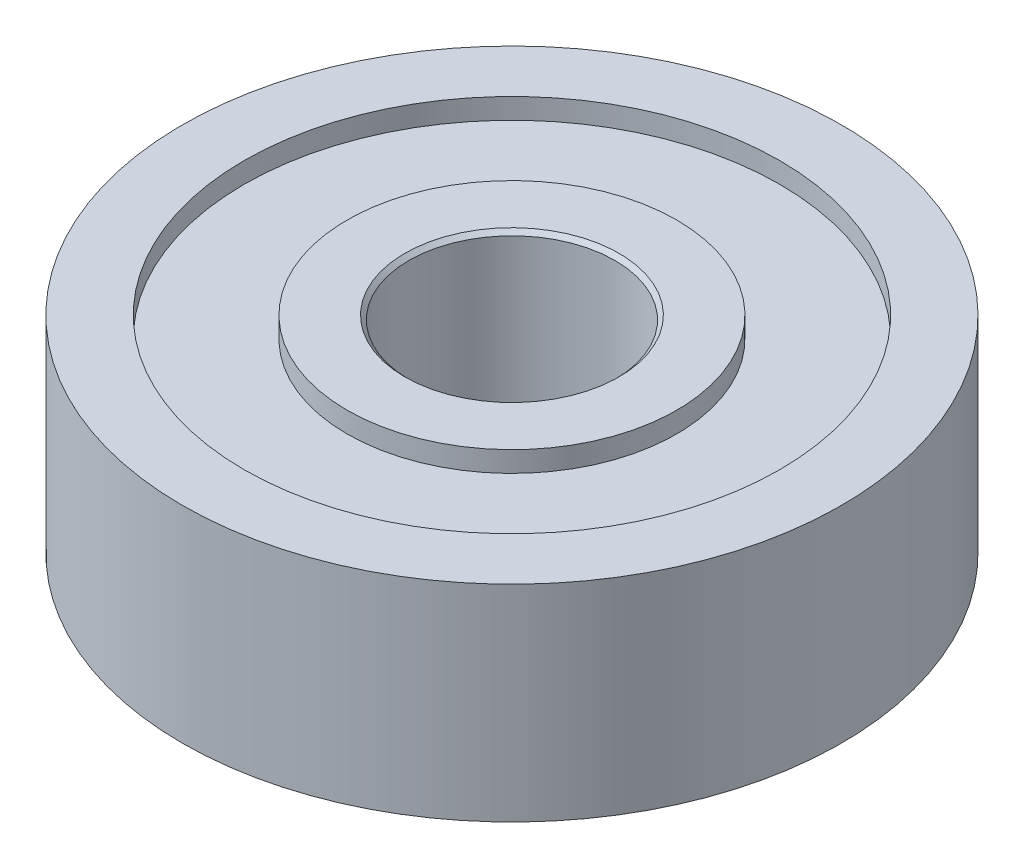
ISO-10303-21;
HEADER;
FILE_DESCRIPTION(('STEP AP214'),'2;1');
FILE_NAME('part.step','',(''),(''),'','','');
FILE_SCHEMA(('AUTOMOTIVE_DESIGN { 1 0 10303 214 1 1 1 1 }'));
ENDSEC;
DATA;
#1=APPLICATION_CONTEXT('core data for automotive mechanical design processes');
#2=APPLICATION_PROTOCOL_DEFINITION('international standard','automotive_design',2000,#1);
#3=PRODUCT_CONTEXT('',#1,'mechanical');
#4=PRODUCT('Part','Part','',(#3));
#5=PRODUCT_RELATED_PRODUCT_CATEGORY('part','',(#4));
#6=PRODUCT_DEFINITION_FORMATION('','',#4);
#7=PRODUCT_DEFINITION_CONTEXT('part definition',#1,'design');
#8=PRODUCT_DEFINITION('design','',#6,#7);
#9=PRODUCT_DEFINITION_SHAPE('','',#8);
#10=(LENGTH_UNIT() NAMED_UNIT(*) SI_UNIT(.MILLI.,.METRE.));
#11=(NAMED_UNIT(*) PLANE_ANGLE_UNIT() SI_UNIT($,.RADIAN.));
#12=(NAMED_UNIT(*) SI_UNIT($,.STERADIAN.) SOLID_ANGLE_UNIT());
#13=UNCERTAINTY_MEASURE_WITH_UNIT(LENGTH_MEASURE(1.E-05),#10,'distance_accuracy_value','');
#14=(GEOMETRIC_REPRESENTATION_CONTEXT(3) GLOBAL_UNCERTAINTY_ASSIGNED_CONTEXT((#13)) GLOBAL_UNIT_ASSIGNED_CONTEXT((#10,
#11,#12)) REPRESENTATION_CONTEXT('',''));
#15=CARTESIAN_POINT('',(0.,0.,0.));
#16=DIRECTION('',(0.,0.,1.));
#17=DIRECTION('',(1.,0.,0.));
#18=AXIS2_PLACEMENT_3D('',#15,#16,#17);
#19=CARTESIAN_POINT('',(0.,-2.5,0.));
#20=DIRECTION('',(0.,1.,0.));
#21=DIRECTION('',(0.,0.,1.));
#22=AXIS2_PLACEMENT_3D('',#19,#20,#21);
#23=PLANE('',#22);
#24=CARTESIAN_POINT('',(0.,-2.5,0.));
#25=DIRECTION('',(0.,1.,0.));
#26=DIRECTION('',(0.,0.,1.));
#27=AXIS2_PLACEMENT_3D('',#24,#25,#26);
#28=CIRCLE('',#27,2.6);
#29=CARTESIAN_POINT('',(0.,-2.5,2.6));
#30=VERTEX_POINT('',#29);
#31=EDGE_CURVE('E10',#30,#30,#28,.T.);
#32=ORIENTED_EDGE('',*,*,#31,.T.);
#33=EDGE_LOOP('',(#32));
#34=FACE_BOUND('',#33,.T.);
#35=CARTESIAN_POINT('',(0.,-2.5,0.));
#36=DIRECTION('',(0.,1.,0.));
#37=DIRECTION('',(0.,0.,1.));
#38=AXIS2_PLACEMENT_3D('',#35,#36,#37);
#39=CIRCLE('',#38,4.);
#40=CARTESIAN_POINT('',(0.,-2.5,4.));
#41=VERTEX_POINT('',#40);
#42=EDGE_CURVE('E84',#41,#41,#39,.T.);
#43=ORIENTED_EDGE('',*,*,#42,.F.);
#44=EDGE_LOOP('',(#43));
#45=FACE_BOUND('',#44,.T.);
#46=ADVANCED_FACE('F38',(#34,#45),#23,.F.);
#47=CARTESIAN_POINT('',(0.,2.5,0.));
#48=DIRECTION('',(0.,1.,0.));
#49=DIRECTION('',(0.,0.,1.));
#50=AXIS2_PLACEMENT_3D('',#47,#48,#49);
#51=PLANE('',#50);
#52=CARTESIAN_POINT('',(0.,2.5,0.));
#53=DIRECTION('',(0.,1.,0.));
#54=DIRECTION('',(0.,0.,1.));
#55=AXIS2_PLACEMENT_3D('',#52,#53,#54);
#56=CIRCLE('',#55,2.6);
#57=CARTESIAN_POINT('',(0.,2.5,2.6));
#58=VERTEX_POINT('',#57);
#59=EDGE_CURVE('E46',#58,#58,#56,.F.);
#60=ORIENTED_EDGE('',*,*,#59,.T.);
#61=EDGE_LOOP('',(#60));
#62=FACE_BOUND('',#61,.T.);
#63=CARTESIAN_POINT('',(0.,2.5,0.));
#64=DIRECTION('',(0.,1.,0.));
#65=DIRECTION('',(0.,0.,1.));
#66=AXIS2_PLACEMENT_3D('',#63,#64,#65);
#67=CIRCLE('',#66,4.);
#68=CARTESIAN_POINT('',(0.,2.5,4.));
#69=VERTEX_POINT('',#68);
#70=EDGE_CURVE('E72',#69,#69,#67,.T.);
#71=ORIENTED_EDGE('',*,*,#70,.T.);
#72=EDGE_LOOP('',(#71));
#73=FACE_BOUND('',#72,.T.);
#74=ADVANCED_FACE('F101',(#62,#73),#51,.T.);
#75=CARTESIAN_POINT('',(0.,2.5,0.));
#76=DIRECTION('',(0.,1.,0.));
#77=DIRECTION('',(0.,0.,1.));
#78=AXIS2_PLACEMENT_3D('',#75,#76,#77);
#79=CIRCLE('',#78,6.5);
#80=CARTESIAN_POINT('',(0.,2.5,6.5));
#81=VERTEX_POINT('',#80);
#82=EDGE_CURVE('E66',#81,#81,#79,.T.);
#83=ORIENTED_EDGE('',*,*,#82,.F.);
#84=EDGE_LOOP('',(#83));
#85=FACE_BOUND('',#84,.T.);
#86=CARTESIAN_POINT('',(0.,2.5,0.));
#87=DIRECTION('',(0.,1.,0.));
#88=DIRECTION('',(0.,0.,1.));
#89=AXIS2_PLACEMENT_3D('',#86,#87,#88);
#90=CIRCLE('',#89,8.);
#91=CARTESIAN_POINT('',(0.,2.5,8.));
#92=VERTEX_POINT('',#91);
#93=EDGE_CURVE('E59',#92,#92,#90,.T.);
#94=ORIENTED_EDGE('',*,*,#93,.T.);
#95=EDGE_LOOP('',(#94));
#96=FACE_BOUND('',#95,.T.);
#97=ADVANCED_FACE('F107',(#85,#96),#51,.T.);
#98=CARTESIAN_POINT('',(0.,-2.5,0.));
#99=DIRECTION('',(0.,1.,0.));
#100=DIRECTION('',(0.,0.,1.));
#101=AXIS2_PLACEMENT_3D('',#98,#99,#100);
#102=CIRCLE('',#101,6.5);
#103=CARTESIAN_POINT('',(0.,-2.5,6.5));
#104=VERTEX_POINT('',#103);
#105=EDGE_CURVE('E78',#104,#104,#102,.T.);
#106=ORIENTED_EDGE('',*,*,#105,.T.);
#107=EDGE_LOOP('',(#106));
#108=FACE_BOUND('',#107,.T.);
#109=CARTESIAN_POINT('',(0.,-2.5,0.));
#110=DIRECTION('',(0.,1.,0.));
#111=DIRECTION('',(0.,0.,1.));
#112=AXIS2_PLACEMENT_3D('',#109,#110,#111);
#113=CIRCLE('',#112,8.);
#114=CARTESIAN_POINT('',(0.,-2.5,8.));
#115=VERTEX_POINT('',#114);
#116=EDGE_CURVE('E60',#115,#115,#113,.T.);
#117=ORIENTED_EDGE('',*,*,#116,.F.);
#118=EDGE_LOOP('',(#117));
#119=FACE_BOUND('',#118,.T.);
#120=ADVANCED_FACE('F103',(#108,#119),#23,.F.);
#121=CARTESIAN_POINT('',(0.,2.5,0.));
#122=DIRECTION('',(0.,-1.,0.));
#123=DIRECTION('',(0.,0.,-1.));
#124=AXIS2_PLACEMENT_3D('',#121,#122,#123);
#125=CYLINDRICAL_SURFACE('',#124,8.);
#126=ORIENTED_EDGE('',*,*,#93,.F.);
#127=EDGE_LOOP('',(#126));
#128=FACE_BOUND('',#127,.T.);
#129=ORIENTED_EDGE('',*,*,#116,.T.);
#130=EDGE_LOOP('',(#129));
#131=FACE_BOUND('',#130,.T.);
#132=ADVANCED_FACE('F111',(#128,#131),#125,.T.);
#133=CARTESIAN_POINT('',(0.,2.5,0.));
#134=DIRECTION('',(0.,-1.,0.));
#135=DIRECTION('',(0.,0.,-1.));
#136=AXIS2_PLACEMENT_3D('',#133,#134,#135);
#137=CYLINDRICAL_SURFACE('',#136,2.5);
#138=CARTESIAN_POINT('',(0.,2.4,0.));
#139=DIRECTION('',(0.,1.,0.));
#140=DIRECTION('',(0.,0.,1.));
#141=AXIS2_PLACEMENT_3D('',#138,#139,#140);
#142=CIRCLE('',#141,2.5);
#143=CARTESIAN_POINT('',(0.,2.4,2.5));
#144=VERTEX_POINT('',#143);
#145=EDGE_CURVE('E50',#144,#144,#142,.T.);
#146=ORIENTED_EDGE('',*,*,#145,.T.);
#147=EDGE_LOOP('',(#146));
#148=FACE_BOUND('',#147,.T.);
#149=CARTESIAN_POINT('',(0.,-2.4,0.));
#150=DIRECTION('',(0.,1.,0.));
#151=DIRECTION('',(0.,0.,1.));
#152=AXIS2_PLACEMENT_3D('',#149,#150,#151);
#153=CIRCLE('',#152,2.5);
#154=CARTESIAN_POINT('',(0.,-2.4,2.5));
#155=VERTEX_POINT('',#154);
#156=EDGE_CURVE('E54',#155,#155,#153,.F.);
#157=ORIENTED_EDGE('',*,*,#156,.T.);
#158=EDGE_LOOP('',(#157));
#159=FACE_BOUND('',#158,.T.);
#160=ADVANCED_FACE('F117',(#148,#159),#137,.F.);
#161=CARTESIAN_POINT('',(0.,2.,0.));
#162=DIRECTION('',(0.,1.,0.));
#163=DIRECTION('',(0.,0.,1.));
#164=AXIS2_PLACEMENT_3D('',#161,#162,#163);
#165=CYLINDRICAL_SURFACE('',#164,6.5);
#166=CARTESIAN_POINT('',(0.,2.,0.));
#167=DIRECTION('',(0.,1.,0.));
#168=DIRECTION('',(0.,0.,1.));
#169=AXIS2_PLACEMENT_3D('',#166,#167,#168);
#170=CIRCLE('',#169,6.5);
#171=CARTESIAN_POINT('',(0.,2.,6.5));
#172=VERTEX_POINT('',#171);
#173=EDGE_CURVE('E63',#172,#172,#170,.T.);
#174=ORIENTED_EDGE('',*,*,#173,.F.);
#175=EDGE_LOOP('',(#174));
#176=FACE_BOUND('',#175,.T.);
#177=ORIENTED_EDGE('',*,*,#82,.T.);
#178=EDGE_LOOP('',(#177));
#179=FACE_BOUND('',#178,.T.);
#180=ADVANCED_FACE('F141',(#176,#179),#165,.F.);
#181=CARTESIAN_POINT('',(0.,2.,0.));
#182=DIRECTION('',(0.,1.,0.));
#183=DIRECTION('',(0.,0.,1.));
#184=AXIS2_PLACEMENT_3D('',#181,#182,#183);
#185=PLANE('',#184);
#186=CARTESIAN_POINT('',(0.,2.,0.));
#187=DIRECTION('',(0.,1.,0.));
#188=DIRECTION('',(0.,0.,1.));
#189=AXIS2_PLACEMENT_3D('',#186,#187,#188);
#190=CIRCLE('',#189,4.);
#191=CARTESIAN_POINT('',(0.,2.,4.));
#192=VERTEX_POINT('',#191);
#193=EDGE_CURVE('E69',#192,#192,#190,.T.);
#194=ORIENTED_EDGE('',*,*,#193,.F.);
#195=EDGE_LOOP('',(#194));
#196=FACE_BOUND('',#195,.T.);
#197=ORIENTED_EDGE('',*,*,#173,.T.);
#198=EDGE_LOOP('',(#197));
#199=FACE_BOUND('',#198,.T.);
#200=ADVANCED_FACE('F137',(#196,#199),#185,.T.);
#201=CARTESIAN_POINT('',(0.,2.,0.));
#202=DIRECTION('',(0.,1.,0.));
#203=DIRECTION('',(0.,0.,1.));
#204=AXIS2_PLACEMENT_3D('',#201,#202,#203);
#205=CYLINDRICAL_SURFACE('',#204,4.);
#206=ORIENTED_EDGE('',*,*,#193,.T.);
#207=EDGE_LOOP('',(#206));
#208=FACE_BOUND('',#207,.T.);
#209=ORIENTED_EDGE('',*,*,#70,.F.);
#210=EDGE_LOOP('',(#209));
#211=FACE_BOUND('',#210,.T.);
#212=ADVANCED_FACE('F131',(#208,#211),#205,.T.);
#213=CARTESIAN_POINT('',(0.,-2.,0.));
#214=DIRECTION('',(0.,-1.,0.));
#215=DIRECTION('',(0.,0.,1.));
#216=AXIS2_PLACEMENT_3D('',#213,#214,#215);
#217=PLANE('',#216);
#218=CARTESIAN_POINT('',(0.,-2.,0.));
#219=DIRECTION('',(0.,1.,0.));
#220=DIRECTION('',(0.,0.,1.));
#221=AXIS2_PLACEMENT_3D('',#218,#219,#220);
#222=CIRCLE('',#221,6.5);
#223=CARTESIAN_POINT('',(0.,-2.,6.5));
#224=VERTEX_POINT('',#223);
#225=EDGE_CURVE('E75',#224,#224,#222,.T.);
#226=ORIENTED_EDGE('',*,*,#225,.F.);
#227=EDGE_LOOP('',(#226));
#228=FACE_BOUND('',#227,.T.);
#229=CARTESIAN_POINT('',(0.,-2.,0.));
#230=DIRECTION('',(0.,1.,0.));
#231=DIRECTION('',(0.,0.,1.));
#232=AXIS2_PLACEMENT_3D('',#229,#230,#231);
#233=CIRCLE('',#232,4.);
#234=CARTESIAN_POINT('',(0.,-2.,4.));
#235=VERTEX_POINT('',#234);
#236=EDGE_CURVE('E81',#235,#235,#233,.T.);
#237=ORIENTED_EDGE('',*,*,#236,.T.);
#238=EDGE_LOOP('',(#237));
#239=FACE_BOUND('',#238,.T.);
#240=ADVANCED_FACE('F90',(#228,#239),#217,.T.);
#241=CARTESIAN_POINT('',(0.,-2.,0.));
#242=DIRECTION('',(0.,-1.,0.));
#243=DIRECTION('',(0.,0.,-1.));
#244=AXIS2_PLACEMENT_3D('',#241,#242,#243);
#245=CYLINDRICAL_SURFACE('',#244,6.5);
#246=ORIENTED_EDGE('',*,*,#225,.T.);
#247=EDGE_LOOP('',(#246));
#248=FACE_BOUND('',#247,.T.);
#249=ORIENTED_EDGE('',*,*,#105,.F.);
#250=EDGE_LOOP('',(#249));
#251=FACE_BOUND('',#250,.T.);
#252=ADVANCED_FACE('F96',(#248,#251),#245,.F.);
#253=CARTESIAN_POINT('',(0.,-2.,0.));
#254=DIRECTION('',(0.,-1.,0.));
#255=DIRECTION('',(0.,0.,-1.));
#256=AXIS2_PLACEMENT_3D('',#253,#254,#255);
#257=CYLINDRICAL_SURFACE('',#256,4.);
#258=ORIENTED_EDGE('',*,*,#236,.F.);
#259=EDGE_LOOP('',(#258));
#260=FACE_BOUND('',#259,.T.);
#261=ORIENTED_EDGE('',*,*,#42,.T.);
#262=EDGE_LOOP('',(#261));
#263=FACE_BOUND('',#262,.T.);
#264=ADVANCED_FACE('F92',(#260,#263),#257,.T.);
#265=CARTESIAN_POINT('',(0.,2.4,0.));
#266=DIRECTION('',(0.,1.,0.));
#267=DIRECTION('',(0.,0.,1.));
#268=AXIS2_PLACEMENT_3D('',#265,#266,#267);
#269=CONICAL_SURFACE('',#268,2.5,0.78539816339745);
#270=ORIENTED_EDGE('',*,*,#59,.F.);
#271=EDGE_LOOP('',(#270));
#272=FACE_BOUND('',#271,.T.);
#273=ORIENTED_EDGE('',*,*,#145,.F.);
#274=EDGE_LOOP('',(#273));
#275=FACE_BOUND('',#274,.T.);
#276=ADVANCED_FACE('F95',(#272,#275),#269,.F.);
#277=CARTESIAN_POINT('',(0.,-2.5,0.));
#278=DIRECTION('',(0.,-1.,0.));
#279=DIRECTION('',(0.,0.,-1.));
#280=AXIS2_PLACEMENT_3D('',#277,#278,#279);
#281=CONICAL_SURFACE('',#280,2.6,0.785398163397455);
#282=ORIENTED_EDGE('',*,*,#156,.F.);
#283=EDGE_LOOP('',(#282));
#284=FACE_BOUND('',#283,.T.);
#285=ORIENTED_EDGE('',*,*,#31,.F.);
#286=EDGE_LOOP('',(#285));
#287=FACE_BOUND('',#286,.T.);
#288=ADVANCED_FACE('F41',(#284,#287),#281,.F.);
#289=CLOSED_SHELL('',(#46,#74,#97,#120,#132,#160,#180,#200,#212,#240,#252,#264,#276,#288));
#290=MANIFOLD_SOLID_BREP('B2',#289);
#291=ADVANCED_BREP_SHAPE_REPRESENTATION('',(#18,#290),#14);
#292=SHAPE_DEFINITION_REPRESENTATION(#9,#291);
ENDSEC;
END-ISO-10303-21;
